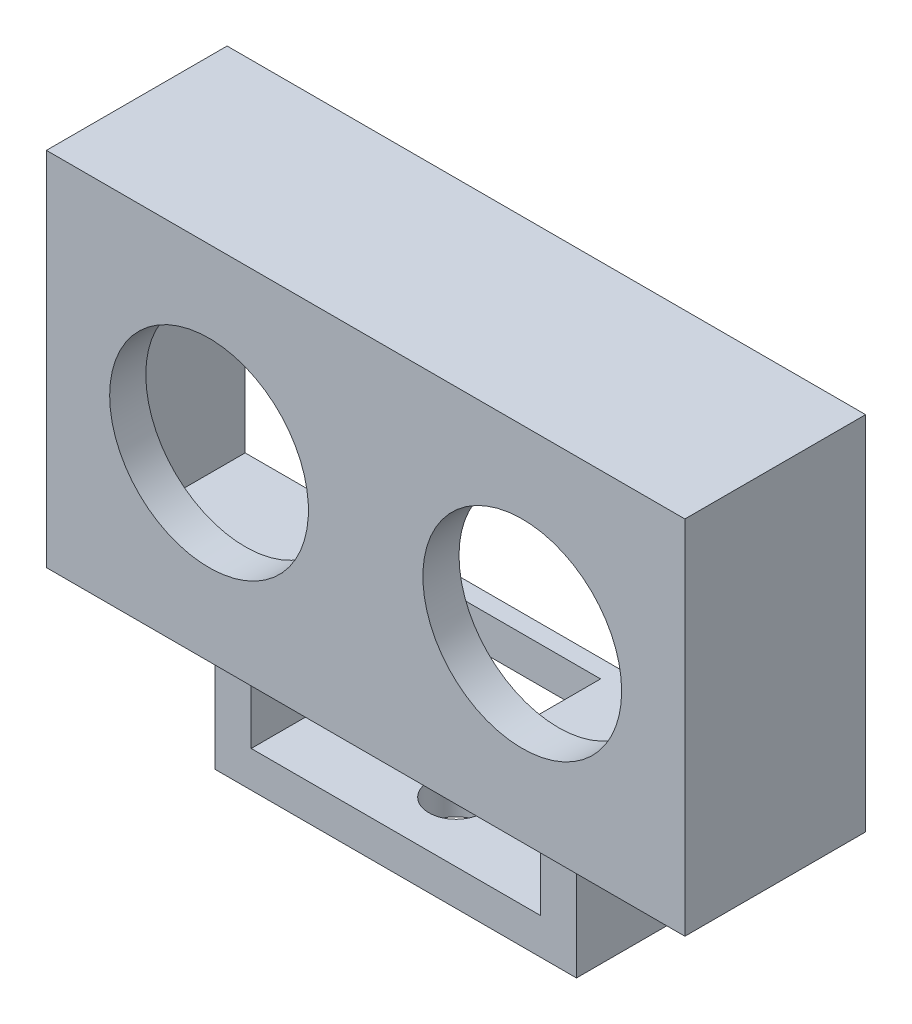
ISO-10303-21;
HEADER;
FILE_DESCRIPTION(('STEP AP214'),'2;1');
FILE_NAME('part.step','',(''),(''),'','','');
FILE_SCHEMA(('AUTOMOTIVE_DESIGN { 1 0 10303 214 1 1 1 1 }'));
ENDSEC;
DATA;
#1=APPLICATION_CONTEXT('core data for automotive mechanical design processes');
#2=APPLICATION_PROTOCOL_DEFINITION('international standard','automotive_design',2000,#1);
#3=PRODUCT_CONTEXT('',#1,'mechanical');
#4=PRODUCT('Part','Part','',(#3));
#5=PRODUCT_RELATED_PRODUCT_CATEGORY('part','',(#4));
#6=PRODUCT_DEFINITION_FORMATION('','',#4);
#7=PRODUCT_DEFINITION_CONTEXT('part definition',#1,'design');
#8=PRODUCT_DEFINITION('design','',#6,#7);
#9=PRODUCT_DEFINITION_SHAPE('','',#8);
#10=(LENGTH_UNIT() NAMED_UNIT(*) SI_UNIT(.MILLI.,.METRE.));
#11=(NAMED_UNIT(*) PLANE_ANGLE_UNIT() SI_UNIT($,.RADIAN.));
#12=(NAMED_UNIT(*) SI_UNIT($,.STERADIAN.) SOLID_ANGLE_UNIT());
#13=UNCERTAINTY_MEASURE_WITH_UNIT(LENGTH_MEASURE(1.E-05),#10,'distance_accuracy_value','');
#14=(GEOMETRIC_REPRESENTATION_CONTEXT(3) GLOBAL_UNCERTAINTY_ASSIGNED_CONTEXT((#13)) GLOBAL_UNIT_ASSIGNED_CONTEXT((#10,
#11,#12)) REPRESENTATION_CONTEXT('',''));
#15=CARTESIAN_POINT('',(0.,0.,0.));
#16=DIRECTION('',(0.,0.,1.));
#17=DIRECTION('',(1.,0.,0.));
#18=AXIS2_PLACEMENT_3D('',#15,#16,#17);
#19=CARTESIAN_POINT('',(-26.5,-15.,15.));
#20=DIRECTION('',(0.,1.,0.));
#21=DIRECTION('',(0.,0.,1.));
#22=AXIS2_PLACEMENT_3D('',#19,#20,#21);
#23=PLANE('',#22);
#24=DIRECTION('',(1.,0.,0.));
#25=VECTOR('',#24,1.);
#26=CARTESIAN_POINT('',(-26.5,-15.,0.));
#27=LINE('',#26,#25);
#28=CARTESIAN_POINT('',(-26.5,-15.,0.));
#29=VERTEX_POINT('',#28);
#30=CARTESIAN_POINT('',(26.5,-15.,0.));
#31=VERTEX_POINT('',#30);
#32=EDGE_CURVE('E347',#29,#31,#27,.T.);
#33=ORIENTED_EDGE('',*,*,#32,.T.);
#34=DIRECTION('',(0.,0.,-1.));
#35=VECTOR('',#34,1.);
#36=CARTESIAN_POINT('',(26.5,-15.,15.));
#37=LINE('',#36,#35);
#38=CARTESIAN_POINT('',(26.5,-15.,15.));
#39=VERTEX_POINT('',#38);
#40=EDGE_CURVE('E353',#39,#31,#37,.T.);
#41=ORIENTED_EDGE('',*,*,#40,.F.);
#42=DIRECTION('',(1.,0.,0.));
#43=VECTOR('',#42,1.);
#44=CARTESIAN_POINT('',(-26.5,-15.,15.));
#45=LINE('',#44,#43);
#46=CARTESIAN_POINT('',(-26.5,-15.,15.));
#47=VERTEX_POINT('',#46);
#48=EDGE_CURVE('E351',#47,#39,#45,.T.);
#49=ORIENTED_EDGE('',*,*,#48,.F.);
#50=DIRECTION('',(0.,0.,-1.));
#51=VECTOR('',#50,1.);
#52=CARTESIAN_POINT('',(-26.5,-15.,15.));
#53=LINE('',#52,#51);
#54=EDGE_CURVE('E363',#47,#29,#53,.T.);
#55=ORIENTED_EDGE('',*,*,#54,.T.);
#56=EDGE_LOOP('',(#33,#41,#49,#55));
#57=FACE_BOUND('',#56,.T.);
#58=DIRECTION('',(0.,0.,1.));
#59=VECTOR('',#58,1.);
#60=CARTESIAN_POINT('',(-12.,-15.,0.));
#61=LINE('',#60,#59);
#62=CARTESIAN_POINT('',(-12.,-15.,2.5));
#63=VERTEX_POINT('',#62);
#64=CARTESIAN_POINT('',(-12.,-15.,12.5));
#65=VERTEX_POINT('',#64);
#66=EDGE_CURVE('E49',#63,#65,#61,.T.);
#67=ORIENTED_EDGE('',*,*,#66,.F.);
#68=DIRECTION('',(1.,0.,0.));
#69=VECTOR('',#68,1.);
#70=CARTESIAN_POINT('',(-15.,-15.,2.5));
#71=LINE('',#70,#69);
#72=CARTESIAN_POINT('',(-15.,-15.,2.5));
#73=VERTEX_POINT('',#72);
#74=EDGE_CURVE('E227',#73,#63,#71,.T.);
#75=ORIENTED_EDGE('',*,*,#74,.F.);
#76=DIRECTION('',(0.,0.,-1.));
#77=VECTOR('',#76,1.);
#78=CARTESIAN_POINT('',(-15.,-15.,12.5));
#79=LINE('',#78,#77);
#80=CARTESIAN_POINT('',(-15.,-15.,12.5));
#81=VERTEX_POINT('',#80);
#82=EDGE_CURVE('E215',#81,#73,#79,.T.);
#83=ORIENTED_EDGE('',*,*,#82,.F.);
#84=DIRECTION('',(-1.,0.,0.));
#85=VECTOR('',#84,1.);
#86=CARTESIAN_POINT('',(-15.,-15.,12.5));
#87=LINE('',#86,#85);
#88=EDGE_CURVE('E208',#65,#81,#87,.T.);
#89=ORIENTED_EDGE('',*,*,#88,.F.);
#90=EDGE_LOOP('',(#67,#75,#83,#89));
#91=FACE_BOUND('',#90,.T.);
#92=CARTESIAN_POINT('',(12.,-15.,2.5));
#93=VERTEX_POINT('',#92);
#94=CARTESIAN_POINT('',(15.,-15.,2.5));
#95=VERTEX_POINT('',#94);
#96=EDGE_CURVE('E226',#93,#95,#71,.T.);
#97=ORIENTED_EDGE('',*,*,#96,.F.);
#98=DIRECTION('',(0.,0.,1.));
#99=VECTOR('',#98,1.);
#100=CARTESIAN_POINT('',(12.,-15.,0.));
#101=LINE('',#100,#99);
#102=CARTESIAN_POINT('',(12.,-15.,12.5));
#103=VERTEX_POINT('',#102);
#104=EDGE_CURVE('E202',#93,#103,#101,.T.);
#105=ORIENTED_EDGE('',*,*,#104,.T.);
#106=CARTESIAN_POINT('',(15.,-15.,12.5));
#107=VERTEX_POINT('',#106);
#108=EDGE_CURVE('E217',#107,#103,#87,.T.);
#109=ORIENTED_EDGE('',*,*,#108,.F.);
#110=DIRECTION('',(0.,0.,1.));
#111=VECTOR('',#110,1.);
#112=CARTESIAN_POINT('',(15.,-15.,12.5));
#113=LINE('',#112,#111);
#114=EDGE_CURVE('E218',#95,#107,#113,.T.);
#115=ORIENTED_EDGE('',*,*,#114,.F.);
#116=EDGE_LOOP('',(#97,#105,#109,#115));
#117=FACE_BOUND('',#116,.T.);
#118=DIRECTION('',(0.,0.,1.));
#119=VECTOR('',#118,1.);
#120=CARTESIAN_POINT('',(-7.5,-15.,15.));
#121=LINE('',#120,#119);
#122=CARTESIAN_POINT('',(-7.5,-15.,3.));
#123=VERTEX_POINT('',#122);
#124=CARTESIAN_POINT('',(-7.5,-15.,8.99999999999999));
#125=VERTEX_POINT('',#124);
#126=EDGE_CURVE('E302',#123,#125,#121,.T.);
#127=ORIENTED_EDGE('',*,*,#126,.T.);
#128=DIRECTION('',(1.,0.,0.));
#129=VECTOR('',#128,1.);
#130=CARTESIAN_POINT('',(-26.5,-15.,8.99999999999999));
#131=LINE('',#130,#129);
#132=CARTESIAN_POINT('',(7.5,-15.,9.));
#133=VERTEX_POINT('',#132);
#134=EDGE_CURVE('E304',#125,#133,#131,.T.);
#135=ORIENTED_EDGE('',*,*,#134,.T.);
#136=DIRECTION('',(0.,0.,-1.));
#137=VECTOR('',#136,1.);
#138=CARTESIAN_POINT('',(7.50000000000001,-15.,15.));
#139=LINE('',#138,#137);
#140=CARTESIAN_POINT('',(7.5,-15.,3.));
#141=VERTEX_POINT('',#140);
#142=EDGE_CURVE('E306',#133,#141,#139,.T.);
#143=ORIENTED_EDGE('',*,*,#142,.T.);
#144=DIRECTION('',(-1.,0.,0.));
#145=VECTOR('',#144,1.);
#146=CARTESIAN_POINT('',(-26.5,-15.,2.99999999999999));
#147=LINE('',#146,#145);
#148=EDGE_CURVE('E294',#141,#123,#147,.T.);
#149=ORIENTED_EDGE('',*,*,#148,.T.);
#150=EDGE_LOOP('',(#127,#135,#143,#149));
#151=FACE_BOUND('',#150,.T.);
#152=ADVANCED_FACE('F33',(#57,#91,#117,#151),#23,.F.);
#153=CARTESIAN_POINT('',(-23.5,12.,12.));
#154=DIRECTION('',(-1.,0.,0.));
#155=DIRECTION('',(0.,0.,1.));
#156=AXIS2_PLACEMENT_3D('',#153,#154,#155);
#157=PLANE('',#156);
#158=DIRECTION('',(0.,-1.,0.));
#159=VECTOR('',#158,1.);
#160=CARTESIAN_POINT('',(-23.5,12.,1.5));
#161=LINE('',#160,#159);
#162=CARTESIAN_POINT('',(-23.5,12.,1.5));
#163=VERTEX_POINT('',#162);
#164=CARTESIAN_POINT('',(-23.5,-12.,1.5));
#165=VERTEX_POINT('',#164);
#166=EDGE_CURVE('E278',#163,#165,#161,.T.);
#167=ORIENTED_EDGE('',*,*,#166,.F.);
#168=DIRECTION('',(0.,0.,-1.));
#169=VECTOR('',#168,1.);
#170=CARTESIAN_POINT('',(-23.5,12.,12.));
#171=LINE('',#170,#169);
#172=CARTESIAN_POINT('',(-23.5,12.,12.));
#173=VERTEX_POINT('',#172);
#174=EDGE_CURVE('E320',#173,#163,#171,.T.);
#175=ORIENTED_EDGE('',*,*,#174,.F.);
#176=DIRECTION('',(0.,1.,0.));
#177=VECTOR('',#176,1.);
#178=CARTESIAN_POINT('',(-23.5,12.,12.));
#179=LINE('',#178,#177);
#180=CARTESIAN_POINT('',(-23.5,-12.,12.));
#181=VERTEX_POINT('',#180);
#182=EDGE_CURVE('E308',#181,#173,#179,.T.);
#183=ORIENTED_EDGE('',*,*,#182,.F.);
#184=DIRECTION('',(0.,0.,-1.));
#185=VECTOR('',#184,1.);
#186=CARTESIAN_POINT('',(-23.5,-12.,12.));
#187=LINE('',#186,#185);
#188=EDGE_CURVE('E321',#181,#165,#187,.T.);
#189=ORIENTED_EDGE('',*,*,#188,.T.);
#190=EDGE_LOOP('',(#167,#175,#183,#189));
#191=FACE_BOUND('',#190,.T.);
#192=ADVANCED_FACE('F393',(#191),#157,.F.);
#193=CARTESIAN_POINT('',(23.5,-12.,12.));
#194=DIRECTION('',(0.,-1.,0.));
#195=DIRECTION('',(0.,0.,-1.));
#196=AXIS2_PLACEMENT_3D('',#193,#194,#195);
#197=PLANE('',#196);
#198=DIRECTION('',(-1.,0.,0.));
#199=VECTOR('',#198,1.);
#200=CARTESIAN_POINT('',(-7.5,-12.,3.));
#201=LINE('',#200,#199);
#202=CARTESIAN_POINT('',(7.5,-12.,3.));
#203=VERTEX_POINT('',#202);
#204=CARTESIAN_POINT('',(-7.5,-12.,3.));
#205=VERTEX_POINT('',#204);
#206=EDGE_CURVE('E282',#203,#205,#201,.T.);
#207=ORIENTED_EDGE('',*,*,#206,.F.);
#208=DIRECTION('',(0.,0.,-1.));
#209=VECTOR('',#208,1.);
#210=CARTESIAN_POINT('',(7.5,-12.,3.));
#211=LINE('',#210,#209);
#212=CARTESIAN_POINT('',(7.5,-12.,9.));
#213=VERTEX_POINT('',#212);
#214=EDGE_CURVE('E280',#213,#203,#211,.T.);
#215=ORIENTED_EDGE('',*,*,#214,.F.);
#216=DIRECTION('',(1.,0.,0.));
#217=VECTOR('',#216,1.);
#218=CARTESIAN_POINT('',(-7.5,-12.,8.99999999999999));
#219=LINE('',#218,#217);
#220=CARTESIAN_POINT('',(-7.5,-12.,8.99999999999999));
#221=VERTEX_POINT('',#220);
#222=EDGE_CURVE('E288',#221,#213,#219,.T.);
#223=ORIENTED_EDGE('',*,*,#222,.F.);
#224=DIRECTION('',(0.,0.,1.));
#225=VECTOR('',#224,1.);
#226=CARTESIAN_POINT('',(-7.5,-12.,3.));
#227=LINE('',#226,#225);
#228=EDGE_CURVE('E285',#205,#221,#227,.T.);
#229=ORIENTED_EDGE('',*,*,#228,.F.);
#230=EDGE_LOOP('',(#207,#215,#223,#229));
#231=FACE_BOUND('',#230,.T.);
#232=DIRECTION('',(1.,0.,0.));
#233=VECTOR('',#232,1.);
#234=CARTESIAN_POINT('',(23.5,-12.,1.5));
#235=LINE('',#234,#233);
#236=CARTESIAN_POINT('',(23.5,-12.,1.5));
#237=VERTEX_POINT('',#236);
#238=EDGE_CURVE('E276',#165,#237,#235,.T.);
#239=ORIENTED_EDGE('',*,*,#238,.F.);
#240=ORIENTED_EDGE('',*,*,#188,.F.);
#241=DIRECTION('',(-1.,0.,0.));
#242=VECTOR('',#241,1.);
#243=CARTESIAN_POINT('',(23.5,-12.,12.));
#244=LINE('',#243,#242);
#245=CARTESIAN_POINT('',(23.5,-12.,12.));
#246=VERTEX_POINT('',#245);
#247=EDGE_CURVE('E317',#246,#181,#244,.T.);
#248=ORIENTED_EDGE('',*,*,#247,.F.);
#249=DIRECTION('',(0.,0.,-1.));
#250=VECTOR('',#249,1.);
#251=CARTESIAN_POINT('',(23.5,-12.,12.));
#252=LINE('',#251,#250);
#253=EDGE_CURVE('E325',#246,#237,#252,.T.);
#254=ORIENTED_EDGE('',*,*,#253,.T.);
#255=EDGE_LOOP('',(#239,#240,#248,#254));
#256=FACE_BOUND('',#255,.T.);
#257=ADVANCED_FACE('F399',(#231,#256),#197,.F.);
#258=CARTESIAN_POINT('',(23.5,12.,12.));
#259=DIRECTION('',(1.,0.,0.));
#260=DIRECTION('',(0.,0.,-1.));
#261=AXIS2_PLACEMENT_3D('',#258,#259,#260);
#262=PLANE('',#261);
#263=DIRECTION('',(0.,1.,0.));
#264=VECTOR('',#263,1.);
#265=CARTESIAN_POINT('',(23.5,12.,1.5));
#266=LINE('',#265,#264);
#267=CARTESIAN_POINT('',(23.5,12.,1.5));
#268=VERTEX_POINT('',#267);
#269=EDGE_CURVE('E268',#237,#268,#266,.T.);
#270=ORIENTED_EDGE('',*,*,#269,.F.);
#271=ORIENTED_EDGE('',*,*,#253,.F.);
#272=DIRECTION('',(0.,-1.,0.));
#273=VECTOR('',#272,1.);
#274=CARTESIAN_POINT('',(23.5,12.,12.));
#275=LINE('',#274,#273);
#276=CARTESIAN_POINT('',(23.5,12.,12.));
#277=VERTEX_POINT('',#276);
#278=EDGE_CURVE('E314',#277,#246,#275,.T.);
#279=ORIENTED_EDGE('',*,*,#278,.F.);
#280=DIRECTION('',(0.,0.,-1.));
#281=VECTOR('',#280,1.);
#282=CARTESIAN_POINT('',(23.5,12.,12.));
#283=LINE('',#282,#281);
#284=EDGE_CURVE('E328',#277,#268,#283,.T.);
#285=ORIENTED_EDGE('',*,*,#284,.T.);
#286=EDGE_LOOP('',(#270,#271,#279,#285));
#287=FACE_BOUND('',#286,.T.);
#288=ADVANCED_FACE('F450',(#287),#262,.F.);
#289=CARTESIAN_POINT('',(23.5,12.,12.));
#290=DIRECTION('',(0.,1.,0.));
#291=DIRECTION('',(0.,0.,1.));
#292=AXIS2_PLACEMENT_3D('',#289,#290,#291);
#293=PLANE('',#292);
#294=DIRECTION('',(-1.,0.,0.));
#295=VECTOR('',#294,1.);
#296=CARTESIAN_POINT('',(23.5,12.,1.5));
#297=LINE('',#296,#295);
#298=EDGE_CURVE('E11',#268,#163,#297,.T.);
#299=ORIENTED_EDGE('',*,*,#298,.F.);
#300=ORIENTED_EDGE('',*,*,#284,.F.);
#301=DIRECTION('',(1.,0.,0.));
#302=VECTOR('',#301,1.);
#303=CARTESIAN_POINT('',(23.5,12.,12.));
#304=LINE('',#303,#302);
#305=EDGE_CURVE('E311',#173,#277,#304,.T.);
#306=ORIENTED_EDGE('',*,*,#305,.F.);
#307=ORIENTED_EDGE('',*,*,#174,.T.);
#308=EDGE_LOOP('',(#299,#300,#306,#307));
#309=FACE_BOUND('',#308,.T.);
#310=ADVANCED_FACE('F388',(#309),#293,.F.);
#311=CARTESIAN_POINT('',(-13.,0.,0.));
#312=DIRECTION('',(0.,0.,1.));
#313=DIRECTION('',(1.,0.,0.));
#314=AXIS2_PLACEMENT_3D('',#311,#312,#313);
#315=CYLINDRICAL_SURFACE('',#314,8.25);
#316=CARTESIAN_POINT('',(-13.,0.,15.));
#317=DIRECTION('',(0.,0.,1.));
#318=DIRECTION('',(-1.,0.,0.));
#319=AXIS2_PLACEMENT_3D('',#316,#317,#318);
#320=CIRCLE('',#319,8.25);
#321=CARTESIAN_POINT('',(-21.25,0.,15.));
#322=VERTEX_POINT('',#321);
#323=EDGE_CURVE('E336',#322,#322,#320,.T.);
#324=ORIENTED_EDGE('',*,*,#323,.T.);
#325=EDGE_LOOP('',(#324));
#326=FACE_BOUND('',#325,.T.);
#327=CARTESIAN_POINT('',(-13.,0.,12.));
#328=DIRECTION('',(0.,0.,-1.));
#329=DIRECTION('',(-1.,0.,0.));
#330=AXIS2_PLACEMENT_3D('',#327,#328,#329);
#331=CIRCLE('',#330,8.25);
#332=CARTESIAN_POINT('',(-21.25,0.,12.));
#333=VERTEX_POINT('',#332);
#334=EDGE_CURVE('E333',#333,#333,#331,.F.);
#335=ORIENTED_EDGE('',*,*,#334,.F.);
#336=EDGE_LOOP('',(#335));
#337=FACE_BOUND('',#336,.T.);
#338=ADVANCED_FACE('F379',(#326,#337),#315,.F.);
#339=CARTESIAN_POINT('',(13.,0.,0.));
#340=DIRECTION('',(0.,0.,1.));
#341=DIRECTION('',(1.,0.,0.));
#342=AXIS2_PLACEMENT_3D('',#339,#340,#341);
#343=CYLINDRICAL_SURFACE('',#342,8.25);
#344=CARTESIAN_POINT('',(13.,0.,15.));
#345=DIRECTION('',(0.,0.,1.));
#346=DIRECTION('',(1.,0.,0.));
#347=AXIS2_PLACEMENT_3D('',#344,#345,#346);
#348=CIRCLE('',#347,8.25);
#349=CARTESIAN_POINT('',(21.25,0.,15.));
#350=VERTEX_POINT('',#349);
#351=EDGE_CURVE('E337',#350,#350,#348,.T.);
#352=ORIENTED_EDGE('',*,*,#351,.T.);
#353=EDGE_LOOP('',(#352));
#354=FACE_BOUND('',#353,.T.);
#355=CARTESIAN_POINT('',(13.,0.,12.));
#356=DIRECTION('',(0.,0.,-1.));
#357=DIRECTION('',(-1.,0.,0.));
#358=AXIS2_PLACEMENT_3D('',#355,#356,#357);
#359=CIRCLE('',#358,8.25);
#360=CARTESIAN_POINT('',(4.75,0.,12.));
#361=VERTEX_POINT('',#360);
#362=EDGE_CURVE('E324',#361,#361,#359,.F.);
#363=ORIENTED_EDGE('',*,*,#362,.F.);
#364=EDGE_LOOP('',(#363));
#365=FACE_BOUND('',#364,.T.);
#366=ADVANCED_FACE('F377',(#354,#365),#343,.F.);
#367=CARTESIAN_POINT('',(26.5,15.,15.));
#368=DIRECTION('',(-1.,0.,0.));
#369=DIRECTION('',(0.,0.,1.));
#370=AXIS2_PLACEMENT_3D('',#367,#368,#369);
#371=PLANE('',#370);
#372=DIRECTION('',(0.,1.,0.));
#373=VECTOR('',#372,1.);
#374=CARTESIAN_POINT('',(26.5,15.,0.));
#375=LINE('',#374,#373);
#376=CARTESIAN_POINT('',(26.5,15.,0.));
#377=VERTEX_POINT('',#376);
#378=EDGE_CURVE('E340',#31,#377,#375,.T.);
#379=ORIENTED_EDGE('',*,*,#378,.T.);
#380=DIRECTION('',(0.,0.,-1.));
#381=VECTOR('',#380,1.);
#382=CARTESIAN_POINT('',(26.5,15.,15.));
#383=LINE('',#382,#381);
#384=CARTESIAN_POINT('',(26.5,15.,15.));
#385=VERTEX_POINT('',#384);
#386=EDGE_CURVE('E42',#385,#377,#383,.T.);
#387=ORIENTED_EDGE('',*,*,#386,.F.);
#388=DIRECTION('',(0.,1.,0.));
#389=VECTOR('',#388,1.);
#390=CARTESIAN_POINT('',(26.5,15.,15.));
#391=LINE('',#390,#389);
#392=EDGE_CURVE('E343',#39,#385,#391,.T.);
#393=ORIENTED_EDGE('',*,*,#392,.F.);
#394=ORIENTED_EDGE('',*,*,#40,.T.);
#395=EDGE_LOOP('',(#379,#387,#393,#394));
#396=FACE_BOUND('',#395,.T.);
#397=ADVANCED_FACE('F35',(#396),#371,.F.);
#398=CARTESIAN_POINT('',(-26.5,15.,15.));
#399=DIRECTION('',(0.,-1.,0.));
#400=DIRECTION('',(0.,0.,-1.));
#401=AXIS2_PLACEMENT_3D('',#398,#399,#400);
#402=PLANE('',#401);
#403=DIRECTION('',(-1.,0.,0.));
#404=VECTOR('',#403,1.);
#405=CARTESIAN_POINT('',(-26.5,15.,0.));
#406=LINE('',#405,#404);
#407=CARTESIAN_POINT('',(-26.5,15.,0.));
#408=VERTEX_POINT('',#407);
#409=EDGE_CURVE('E356',#377,#408,#406,.T.);
#410=ORIENTED_EDGE('',*,*,#409,.T.);
#411=DIRECTION('',(0.,0.,-1.));
#412=VECTOR('',#411,1.);
#413=CARTESIAN_POINT('',(-26.5,15.,15.));
#414=LINE('',#413,#412);
#415=CARTESIAN_POINT('',(-26.5,15.,15.));
#416=VERTEX_POINT('',#415);
#417=EDGE_CURVE('E366',#416,#408,#414,.T.);
#418=ORIENTED_EDGE('',*,*,#417,.F.);
#419=DIRECTION('',(-1.,0.,0.));
#420=VECTOR('',#419,1.);
#421=CARTESIAN_POINT('',(-26.5,15.,15.));
#422=LINE('',#421,#420);
#423=EDGE_CURVE('E346',#385,#416,#422,.T.);
#424=ORIENTED_EDGE('',*,*,#423,.F.);
#425=ORIENTED_EDGE('',*,*,#386,.T.);
#426=EDGE_LOOP('',(#410,#418,#424,#425));
#427=FACE_BOUND('',#426,.T.);
#428=ADVANCED_FACE('F386',(#427),#402,.F.);
#429=CARTESIAN_POINT('',(-26.5,15.,15.));
#430=DIRECTION('',(1.,0.,0.));
#431=DIRECTION('',(0.,1.,0.));
#432=AXIS2_PLACEMENT_3D('',#429,#430,#431);
#433=PLANE('',#432);
#434=DIRECTION('',(0.,-1.,0.));
#435=VECTOR('',#434,1.);
#436=CARTESIAN_POINT('',(-26.5,15.,0.));
#437=LINE('',#436,#435);
#438=EDGE_CURVE('E358',#408,#29,#437,.T.);
#439=ORIENTED_EDGE('',*,*,#438,.T.);
#440=ORIENTED_EDGE('',*,*,#54,.F.);
#441=DIRECTION('',(0.,-1.,0.));
#442=VECTOR('',#441,1.);
#443=CARTESIAN_POINT('',(-26.5,15.,15.));
#444=LINE('',#443,#442);
#445=EDGE_CURVE('E349',#416,#47,#444,.T.);
#446=ORIENTED_EDGE('',*,*,#445,.F.);
#447=ORIENTED_EDGE('',*,*,#417,.T.);
#448=EDGE_LOOP('',(#439,#440,#446,#447));
#449=FACE_BOUND('',#448,.T.);
#450=ADVANCED_FACE('F405',(#449),#433,.F.);
#451=CARTESIAN_POINT('',(0.,0.,15.));
#452=DIRECTION('',(0.,0.,1.));
#453=DIRECTION('',(1.,0.,0.));
#454=AXIS2_PLACEMENT_3D('',#451,#452,#453);
#455=PLANE('',#454);
#456=ORIENTED_EDGE('',*,*,#351,.F.);
#457=EDGE_LOOP('',(#456));
#458=FACE_BOUND('',#457,.T.);
#459=ORIENTED_EDGE('',*,*,#323,.F.);
#460=EDGE_LOOP('',(#459));
#461=FACE_BOUND('',#460,.T.);
#462=ORIENTED_EDGE('',*,*,#392,.T.);
#463=ORIENTED_EDGE('',*,*,#423,.T.);
#464=ORIENTED_EDGE('',*,*,#445,.T.);
#465=ORIENTED_EDGE('',*,*,#48,.T.);
#466=EDGE_LOOP('',(#462,#463,#464,#465));
#467=FACE_BOUND('',#466,.T.);
#468=ADVANCED_FACE('F407',(#458,#461,#467),#455,.T.);
#469=CARTESIAN_POINT('',(0.,0.,0.));
#470=DIRECTION('',(0.,0.,1.));
#471=DIRECTION('',(1.,0.,0.));
#472=AXIS2_PLACEMENT_3D('',#469,#470,#471);
#473=PLANE('',#472);
#474=DIRECTION('',(1.,0.,0.));
#475=VECTOR('',#474,1.);
#476=CARTESIAN_POINT('',(25.,13.5,0.));
#477=LINE('',#476,#475);
#478=CARTESIAN_POINT('',(-25.,13.5,0.));
#479=VERTEX_POINT('',#478);
#480=CARTESIAN_POINT('',(25.,13.5,0.));
#481=VERTEX_POINT('',#480);
#482=EDGE_CURVE('E258',#479,#481,#477,.T.);
#483=ORIENTED_EDGE('',*,*,#482,.F.);
#484=DIRECTION('',(0.,1.,0.));
#485=VECTOR('',#484,1.);
#486=CARTESIAN_POINT('',(-25.,13.5,0.));
#487=LINE('',#486,#485);
#488=CARTESIAN_POINT('',(-25.,-13.5,0.));
#489=VERTEX_POINT('',#488);
#490=EDGE_CURVE('E242',#489,#479,#487,.T.);
#491=ORIENTED_EDGE('',*,*,#490,.F.);
#492=DIRECTION('',(-1.,0.,0.));
#493=VECTOR('',#492,1.);
#494=CARTESIAN_POINT('',(25.,-13.5,0.));
#495=LINE('',#494,#493);
#496=CARTESIAN_POINT('',(25.,-13.5,0.));
#497=VERTEX_POINT('',#496);
#498=EDGE_CURVE('E247',#497,#489,#495,.T.);
#499=ORIENTED_EDGE('',*,*,#498,.F.);
#500=DIRECTION('',(0.,-1.,0.));
#501=VECTOR('',#500,1.);
#502=CARTESIAN_POINT('',(25.,13.5,0.));
#503=LINE('',#502,#501);
#504=EDGE_CURVE('E261',#481,#497,#503,.T.);
#505=ORIENTED_EDGE('',*,*,#504,.F.);
#506=EDGE_LOOP('',(#483,#491,#499,#505));
#507=FACE_BOUND('',#506,.T.);
#508=ORIENTED_EDGE('',*,*,#378,.F.);
#509=ORIENTED_EDGE('',*,*,#32,.F.);
#510=ORIENTED_EDGE('',*,*,#438,.F.);
#511=ORIENTED_EDGE('',*,*,#409,.F.);
#512=EDGE_LOOP('',(#508,#509,#510,#511));
#513=FACE_BOUND('',#512,.T.);
#514=ADVANCED_FACE('F403',(#507,#513),#473,.F.);
#515=CARTESIAN_POINT('',(0.,0.,12.));
#516=DIRECTION('',(0.,0.,-1.));
#517=DIRECTION('',(-1.,0.,0.));
#518=AXIS2_PLACEMENT_3D('',#515,#516,#517);
#519=PLANE('',#518);
#520=ORIENTED_EDGE('',*,*,#182,.T.);
#521=ORIENTED_EDGE('',*,*,#305,.T.);
#522=ORIENTED_EDGE('',*,*,#278,.T.);
#523=ORIENTED_EDGE('',*,*,#247,.T.);
#524=EDGE_LOOP('',(#520,#521,#522,#523));
#525=FACE_BOUND('',#524,.T.);
#526=ORIENTED_EDGE('',*,*,#362,.T.);
#527=EDGE_LOOP('',(#526));
#528=FACE_BOUND('',#527,.T.);
#529=ORIENTED_EDGE('',*,*,#334,.T.);
#530=EDGE_LOOP('',(#529));
#531=FACE_BOUND('',#530,.T.);
#532=ADVANCED_FACE('F374',(#525,#528,#531),#519,.T.);
#533=CARTESIAN_POINT('',(7.5,-24.,3.));
#534=DIRECTION('',(1.,0.,0.));
#535=DIRECTION('',(0.,0.,-1.));
#536=AXIS2_PLACEMENT_3D('',#533,#534,#535);
#537=PLANE('',#536);
#538=DIRECTION('',(0.,1.,0.));
#539=VECTOR('',#538,1.);
#540=CARTESIAN_POINT('',(7.5,-24.,9.));
#541=LINE('',#540,#539);
#542=EDGE_CURVE('E292',#133,#213,#541,.T.);
#543=ORIENTED_EDGE('',*,*,#542,.T.);
#544=ORIENTED_EDGE('',*,*,#214,.T.);
#545=DIRECTION('',(0.,1.,0.));
#546=VECTOR('',#545,1.);
#547=CARTESIAN_POINT('',(7.5,-24.,3.));
#548=LINE('',#547,#546);
#549=EDGE_CURVE('E291',#141,#203,#548,.T.);
#550=ORIENTED_EDGE('',*,*,#549,.F.);
#551=ORIENTED_EDGE('',*,*,#142,.F.);
#552=EDGE_LOOP('',(#543,#544,#550,#551));
#553=FACE_BOUND('',#552,.T.);
#554=ADVANCED_FACE('F437',(#553),#537,.F.);
#555=CARTESIAN_POINT('',(-7.5,-24.,8.99999999999999));
#556=DIRECTION('',(0.,0.,1.));
#557=DIRECTION('',(1.,0.,0.));
#558=AXIS2_PLACEMENT_3D('',#555,#556,#557);
#559=PLANE('',#558);
#560=DIRECTION('',(0.,1.,0.));
#561=VECTOR('',#560,1.);
#562=CARTESIAN_POINT('',(-7.5,-24.,8.99999999999999));
#563=LINE('',#562,#561);
#564=EDGE_CURVE('E295',#125,#221,#563,.T.);
#565=ORIENTED_EDGE('',*,*,#564,.T.);
#566=ORIENTED_EDGE('',*,*,#222,.T.);
#567=ORIENTED_EDGE('',*,*,#542,.F.);
#568=ORIENTED_EDGE('',*,*,#134,.F.);
#569=EDGE_LOOP('',(#565,#566,#567,#568));
#570=FACE_BOUND('',#569,.T.);
#571=ADVANCED_FACE('F443',(#570),#559,.F.);
#572=CARTESIAN_POINT('',(-7.5,-24.,3.));
#573=DIRECTION('',(-1.,0.,0.));
#574=DIRECTION('',(0.,0.,1.));
#575=AXIS2_PLACEMENT_3D('',#572,#573,#574);
#576=PLANE('',#575);
#577=DIRECTION('',(0.,1.,0.));
#578=VECTOR('',#577,1.);
#579=CARTESIAN_POINT('',(-7.5,-24.,3.));
#580=LINE('',#579,#578);
#581=EDGE_CURVE('E297',#123,#205,#580,.T.);
#582=ORIENTED_EDGE('',*,*,#581,.T.);
#583=ORIENTED_EDGE('',*,*,#228,.T.);
#584=ORIENTED_EDGE('',*,*,#564,.F.);
#585=ORIENTED_EDGE('',*,*,#126,.F.);
#586=EDGE_LOOP('',(#582,#583,#584,#585));
#587=FACE_BOUND('',#586,.T.);
#588=ADVANCED_FACE('F482',(#587),#576,.F.);
#589=CARTESIAN_POINT('',(-7.5,-24.,3.));
#590=DIRECTION('',(0.,0.,-1.));
#591=DIRECTION('',(-1.,0.,0.));
#592=AXIS2_PLACEMENT_3D('',#589,#590,#591);
#593=PLANE('',#592);
#594=ORIENTED_EDGE('',*,*,#549,.T.);
#595=ORIENTED_EDGE('',*,*,#206,.T.);
#596=ORIENTED_EDGE('',*,*,#581,.F.);
#597=ORIENTED_EDGE('',*,*,#148,.F.);
#598=EDGE_LOOP('',(#594,#595,#596,#597));
#599=FACE_BOUND('',#598,.T.);
#600=ADVANCED_FACE('F472',(#599),#593,.F.);
#601=CARTESIAN_POINT('',(0.,0.,1.5));
#602=DIRECTION('',(0.,0.,-1.));
#603=DIRECTION('',(-1.,0.,0.));
#604=AXIS2_PLACEMENT_3D('',#601,#602,#603);
#605=PLANE('',#604);
#606=DIRECTION('',(0.,1.,0.));
#607=VECTOR('',#606,1.);
#608=CARTESIAN_POINT('',(-25.,13.5,1.5));
#609=LINE('',#608,#607);
#610=CARTESIAN_POINT('',(-25.,-13.5,1.5));
#611=VERTEX_POINT('',#610);
#612=CARTESIAN_POINT('',(-25.,13.5,1.5));
#613=VERTEX_POINT('',#612);
#614=EDGE_CURVE('E243',#611,#613,#609,.T.);
#615=ORIENTED_EDGE('',*,*,#614,.T.);
#616=DIRECTION('',(1.,0.,0.));
#617=VECTOR('',#616,1.);
#618=CARTESIAN_POINT('',(25.,13.5,1.5));
#619=LINE('',#618,#617);
#620=CARTESIAN_POINT('',(25.,13.5,1.5));
#621=VERTEX_POINT('',#620);
#622=EDGE_CURVE('E246',#613,#621,#619,.T.);
#623=ORIENTED_EDGE('',*,*,#622,.T.);
#624=DIRECTION('',(0.,-1.,0.));
#625=VECTOR('',#624,1.);
#626=CARTESIAN_POINT('',(25.,13.5,1.5));
#627=LINE('',#626,#625);
#628=CARTESIAN_POINT('',(25.,-13.5,1.5));
#629=VERTEX_POINT('',#628);
#630=EDGE_CURVE('E250',#621,#629,#627,.T.);
#631=ORIENTED_EDGE('',*,*,#630,.T.);
#632=DIRECTION('',(-1.,0.,0.));
#633=VECTOR('',#632,1.);
#634=CARTESIAN_POINT('',(25.,-13.5,1.5));
#635=LINE('',#634,#633);
#636=EDGE_CURVE('E253',#629,#611,#635,.T.);
#637=ORIENTED_EDGE('',*,*,#636,.T.);
#638=EDGE_LOOP('',(#615,#623,#631,#637));
#639=FACE_BOUND('',#638,.T.);
#640=ORIENTED_EDGE('',*,*,#166,.T.);
#641=ORIENTED_EDGE('',*,*,#238,.T.);
#642=ORIENTED_EDGE('',*,*,#269,.T.);
#643=ORIENTED_EDGE('',*,*,#298,.T.);
#644=EDGE_LOOP('',(#640,#641,#642,#643));
#645=FACE_BOUND('',#644,.T.);
#646=ADVANCED_FACE('F468',(#639,#645),#605,.T.);
#647=CARTESIAN_POINT('',(-25.,13.5,1.5));
#648=DIRECTION('',(-1.,0.,0.));
#649=DIRECTION('',(0.,0.,1.));
#650=AXIS2_PLACEMENT_3D('',#647,#648,#649);
#651=PLANE('',#650);
#652=ORIENTED_EDGE('',*,*,#490,.T.);
#653=DIRECTION('',(0.,0.,-1.));
#654=VECTOR('',#653,1.);
#655=CARTESIAN_POINT('',(-25.,13.5,1.5));
#656=LINE('',#655,#654);
#657=EDGE_CURVE('E256',#613,#479,#656,.T.);
#658=ORIENTED_EDGE('',*,*,#657,.F.);
#659=ORIENTED_EDGE('',*,*,#614,.F.);
#660=DIRECTION('',(0.,0.,-1.));
#661=VECTOR('',#660,1.);
#662=CARTESIAN_POINT('',(-25.,-13.5,1.5));
#663=LINE('',#662,#661);
#664=EDGE_CURVE('E266',#611,#489,#663,.T.);
#665=ORIENTED_EDGE('',*,*,#664,.T.);
#666=EDGE_LOOP('',(#652,#658,#659,#665));
#667=FACE_BOUND('',#666,.T.);
#668=ADVANCED_FACE('F471',(#667),#651,.F.);
#669=CARTESIAN_POINT('',(25.,-13.5,1.5));
#670=DIRECTION('',(0.,-1.,0.));
#671=DIRECTION('',(0.,0.,-1.));
#672=AXIS2_PLACEMENT_3D('',#669,#670,#671);
#673=PLANE('',#672);
#674=ORIENTED_EDGE('',*,*,#498,.T.);
#675=ORIENTED_EDGE('',*,*,#664,.F.);
#676=ORIENTED_EDGE('',*,*,#636,.F.);
#677=DIRECTION('',(0.,0.,-1.));
#678=VECTOR('',#677,1.);
#679=CARTESIAN_POINT('',(25.,-13.5,1.5));
#680=LINE('',#679,#678);
#681=EDGE_CURVE('E269',#629,#497,#680,.T.);
#682=ORIENTED_EDGE('',*,*,#681,.T.);
#683=EDGE_LOOP('',(#674,#675,#676,#682));
#684=FACE_BOUND('',#683,.T.);
#685=ADVANCED_FACE('F479',(#684),#673,.F.);
#686=CARTESIAN_POINT('',(25.,13.5,1.5));
#687=DIRECTION('',(1.,0.,0.));
#688=DIRECTION('',(0.,0.,-1.));
#689=AXIS2_PLACEMENT_3D('',#686,#687,#688);
#690=PLANE('',#689);
#691=ORIENTED_EDGE('',*,*,#504,.T.);
#692=ORIENTED_EDGE('',*,*,#681,.F.);
#693=ORIENTED_EDGE('',*,*,#630,.F.);
#694=DIRECTION('',(0.,0.,-1.));
#695=VECTOR('',#694,1.);
#696=CARTESIAN_POINT('',(25.,13.5,1.5));
#697=LINE('',#696,#695);
#698=EDGE_CURVE('E271',#621,#481,#697,.T.);
#699=ORIENTED_EDGE('',*,*,#698,.T.);
#700=EDGE_LOOP('',(#691,#692,#693,#699));
#701=FACE_BOUND('',#700,.T.);
#702=ADVANCED_FACE('F490',(#701),#690,.F.);
#703=CARTESIAN_POINT('',(25.,13.5,1.5));
#704=DIRECTION('',(0.,1.,0.));
#705=DIRECTION('',(0.,0.,1.));
#706=AXIS2_PLACEMENT_3D('',#703,#704,#705);
#707=PLANE('',#706);
#708=ORIENTED_EDGE('',*,*,#482,.T.);
#709=ORIENTED_EDGE('',*,*,#698,.F.);
#710=ORIENTED_EDGE('',*,*,#622,.F.);
#711=ORIENTED_EDGE('',*,*,#657,.T.);
#712=EDGE_LOOP('',(#708,#709,#710,#711));
#713=FACE_BOUND('',#712,.T.);
#714=ADVANCED_FACE('F494',(#713),#707,.F.);
#715=CARTESIAN_POINT('',(0.,-25.,0.));
#716=DIRECTION('',(0.,-1.,0.));
#717=DIRECTION('',(0.,0.,-1.));
#718=AXIS2_PLACEMENT_3D('',#715,#716,#717);
#719=PLANE('',#718);
#720=CARTESIAN_POINT('',(0.,-25.,7.5));
#721=DIRECTION('',(0.,-1.,0.));
#722=DIRECTION('',(0.,0.,-1.));
#723=AXIS2_PLACEMENT_3D('',#720,#721,#722);
#724=CIRCLE('',#723,2.25);
#725=CARTESIAN_POINT('',(0.,-25.,5.25));
#726=VERTEX_POINT('',#725);
#727=EDGE_CURVE('E632',#726,#726,#724,.T.);
#728=ORIENTED_EDGE('',*,*,#727,.F.);
#729=EDGE_LOOP('',(#728));
#730=FACE_BOUND('',#729,.T.);
#731=DIRECTION('',(0.,0.,1.));
#732=VECTOR('',#731,1.);
#733=CARTESIAN_POINT('',(15.,-25.,12.5));
#734=LINE('',#733,#732);
#735=CARTESIAN_POINT('',(15.,-25.,2.5));
#736=VERTEX_POINT('',#735);
#737=CARTESIAN_POINT('',(15.,-25.,12.5));
#738=VERTEX_POINT('',#737);
#739=EDGE_CURVE('E229',#736,#738,#734,.T.);
#740=ORIENTED_EDGE('',*,*,#739,.T.);
#741=DIRECTION('',(-1.,0.,0.));
#742=VECTOR('',#741,1.);
#743=CARTESIAN_POINT('',(-15.,-25.,12.5));
#744=LINE('',#743,#742);
#745=CARTESIAN_POINT('',(-15.,-25.,12.5));
#746=VERTEX_POINT('',#745);
#747=EDGE_CURVE('E616',#738,#746,#744,.T.);
#748=ORIENTED_EDGE('',*,*,#747,.T.);
#749=DIRECTION('',(0.,0.,-1.));
#750=VECTOR('',#749,1.);
#751=CARTESIAN_POINT('',(-15.,-25.,12.5));
#752=LINE('',#751,#750);
#753=CARTESIAN_POINT('',(-15.,-25.,2.5));
#754=VERTEX_POINT('',#753);
#755=EDGE_CURVE('E615',#746,#754,#752,.T.);
#756=ORIENTED_EDGE('',*,*,#755,.T.);
#757=DIRECTION('',(1.,0.,0.));
#758=VECTOR('',#757,1.);
#759=CARTESIAN_POINT('',(-15.,-25.,2.5));
#760=LINE('',#759,#758);
#761=EDGE_CURVE('E234',#754,#736,#760,.T.);
#762=ORIENTED_EDGE('',*,*,#761,.T.);
#763=EDGE_LOOP('',(#740,#748,#756,#762));
#764=FACE_BOUND('',#763,.T.);
#765=ADVANCED_FACE('F497',(#730,#764),#719,.T.);
#766=CARTESIAN_POINT('',(-15.,-25.,2.5));
#767=DIRECTION('',(0.,0.,1.));
#768=DIRECTION('',(1.,0.,0.));
#769=AXIS2_PLACEMENT_3D('',#766,#767,#768);
#770=PLANE('',#769);
#771=DIRECTION('',(1.,0.,0.));
#772=VECTOR('',#771,1.);
#773=CARTESIAN_POINT('',(-15.,-22.,2.5));
#774=LINE('',#773,#772);
#775=CARTESIAN_POINT('',(-12.,-22.,2.5));
#776=VERTEX_POINT('',#775);
#777=CARTESIAN_POINT('',(12.,-22.,2.5));
#778=VERTEX_POINT('',#777);
#779=EDGE_CURVE('E623',#776,#778,#774,.T.);
#780=ORIENTED_EDGE('',*,*,#779,.T.);
#781=DIRECTION('',(0.,1.,0.));
#782=VECTOR('',#781,1.);
#783=CARTESIAN_POINT('',(12.,-25.,2.5));
#784=LINE('',#783,#782);
#785=EDGE_CURVE('E221',#778,#93,#784,.T.);
#786=ORIENTED_EDGE('',*,*,#785,.T.);
#787=ORIENTED_EDGE('',*,*,#96,.T.);
#788=DIRECTION('',(0.,1.,0.));
#789=VECTOR('',#788,1.);
#790=CARTESIAN_POINT('',(15.,-25.,2.5));
#791=LINE('',#790,#789);
#792=EDGE_CURVE('E230',#736,#95,#791,.T.);
#793=ORIENTED_EDGE('',*,*,#792,.F.);
#794=ORIENTED_EDGE('',*,*,#761,.F.);
#795=DIRECTION('',(0.,1.,0.));
#796=VECTOR('',#795,1.);
#797=CARTESIAN_POINT('',(-15.,-25.,2.5));
#798=LINE('',#797,#796);
#799=EDGE_CURVE('E233',#754,#73,#798,.T.);
#800=ORIENTED_EDGE('',*,*,#799,.T.);
#801=ORIENTED_EDGE('',*,*,#74,.T.);
#802=DIRECTION('',(0.,-1.,0.));
#803=VECTOR('',#802,1.);
#804=CARTESIAN_POINT('',(-12.,-25.,2.5));
#805=LINE('',#804,#803);
#806=EDGE_CURVE('E199',#63,#776,#805,.T.);
#807=ORIENTED_EDGE('',*,*,#806,.T.);
#808=EDGE_LOOP('',(#780,#786,#787,#793,#794,#800,#801,#807));
#809=FACE_BOUND('',#808,.T.);
#810=ADVANCED_FACE('F532',(#809),#770,.F.);
#811=CARTESIAN_POINT('',(-15.,-25.,12.5));
#812=DIRECTION('',(1.,0.,0.));
#813=DIRECTION('',(0.,0.,-1.));
#814=AXIS2_PLACEMENT_3D('',#811,#812,#813);
#815=PLANE('',#814);
#816=ORIENTED_EDGE('',*,*,#82,.T.);
#817=ORIENTED_EDGE('',*,*,#799,.F.);
#818=ORIENTED_EDGE('',*,*,#755,.F.);
#819=DIRECTION('',(0.,1.,0.));
#820=VECTOR('',#819,1.);
#821=CARTESIAN_POINT('',(-15.,-25.,12.5));
#822=LINE('',#821,#820);
#823=EDGE_CURVE('E237',#746,#81,#822,.T.);
#824=ORIENTED_EDGE('',*,*,#823,.T.);
#825=EDGE_LOOP('',(#816,#817,#818,#824));
#826=FACE_BOUND('',#825,.T.);
#827=ADVANCED_FACE('F537',(#826),#815,.F.);
#828=CARTESIAN_POINT('',(-15.,-25.,12.5));
#829=DIRECTION('',(0.,0.,-1.));
#830=DIRECTION('',(-1.,0.,0.));
#831=AXIS2_PLACEMENT_3D('',#828,#829,#830);
#832=PLANE('',#831);
#833=ORIENTED_EDGE('',*,*,#108,.T.);
#834=DIRECTION('',(0.,1.,0.));
#835=VECTOR('',#834,1.);
#836=CARTESIAN_POINT('',(12.,-15.,12.5));
#837=LINE('',#836,#835);
#838=CARTESIAN_POINT('',(12.,-22.,12.5));
#839=VERTEX_POINT('',#838);
#840=EDGE_CURVE('E57',#839,#103,#837,.T.);
#841=ORIENTED_EDGE('',*,*,#840,.F.);
#842=DIRECTION('',(1.,0.,0.));
#843=VECTOR('',#842,1.);
#844=CARTESIAN_POINT('',(-12.,-22.,12.5));
#845=LINE('',#844,#843);
#846=CARTESIAN_POINT('',(-12.,-22.,12.5));
#847=VERTEX_POINT('',#846);
#848=EDGE_CURVE('E211',#847,#839,#845,.T.);
#849=ORIENTED_EDGE('',*,*,#848,.F.);
#850=DIRECTION('',(0.,-1.,0.));
#851=VECTOR('',#850,1.);
#852=CARTESIAN_POINT('',(-12.,-15.,12.5));
#853=LINE('',#852,#851);
#854=EDGE_CURVE('E196',#65,#847,#853,.T.);
#855=ORIENTED_EDGE('',*,*,#854,.F.);
#856=ORIENTED_EDGE('',*,*,#88,.T.);
#857=ORIENTED_EDGE('',*,*,#823,.F.);
#858=ORIENTED_EDGE('',*,*,#747,.F.);
#859=DIRECTION('',(0.,1.,0.));
#860=VECTOR('',#859,1.);
#861=CARTESIAN_POINT('',(15.,-25.,12.5));
#862=LINE('',#861,#860);
#863=EDGE_CURVE('E239',#738,#107,#862,.T.);
#864=ORIENTED_EDGE('',*,*,#863,.T.);
#865=EDGE_LOOP('',(#833,#841,#849,#855,#856,#857,#858,#864));
#866=FACE_BOUND('',#865,.T.);
#867=ADVANCED_FACE('F206',(#866),#832,.F.);
#868=CARTESIAN_POINT('',(15.,-25.,12.5));
#869=DIRECTION('',(-1.,0.,0.));
#870=DIRECTION('',(0.,0.,1.));
#871=AXIS2_PLACEMENT_3D('',#868,#869,#870);
#872=PLANE('',#871);
#873=ORIENTED_EDGE('',*,*,#114,.T.);
#874=ORIENTED_EDGE('',*,*,#863,.F.);
#875=ORIENTED_EDGE('',*,*,#739,.F.);
#876=ORIENTED_EDGE('',*,*,#792,.T.);
#877=EDGE_LOOP('',(#873,#874,#875,#876));
#878=FACE_BOUND('',#877,.T.);
#879=ADVANCED_FACE('F486',(#878),#872,.F.);
#880=CARTESIAN_POINT('',(12.,-15.,0.));
#881=DIRECTION('',(1.,0.,0.));
#882=DIRECTION('',(0.,1.,0.));
#883=AXIS2_PLACEMENT_3D('',#880,#881,#882);
#884=PLANE('',#883);
#885=DIRECTION('',(0.,0.,1.));
#886=VECTOR('',#885,1.);
#887=CARTESIAN_POINT('',(12.,-22.,0.));
#888=LINE('',#887,#886);
#889=EDGE_CURVE('E626',#778,#839,#888,.T.);
#890=ORIENTED_EDGE('',*,*,#889,.T.);
#891=ORIENTED_EDGE('',*,*,#840,.T.);
#892=ORIENTED_EDGE('',*,*,#104,.F.);
#893=ORIENTED_EDGE('',*,*,#785,.F.);
#894=EDGE_LOOP('',(#890,#891,#892,#893));
#895=FACE_BOUND('',#894,.T.);
#896=ADVANCED_FACE('F556',(#895),#884,.F.);
#897=CARTESIAN_POINT('',(-12.,-22.,0.));
#898=DIRECTION('',(0.,-1.,0.));
#899=DIRECTION('',(0.,0.,-1.));
#900=AXIS2_PLACEMENT_3D('',#897,#898,#899);
#901=PLANE('',#900);
#902=CARTESIAN_POINT('',(0.,-22.,7.5));
#903=DIRECTION('',(0.,-1.,0.));
#904=DIRECTION('',(0.,0.,-1.));
#905=AXIS2_PLACEMENT_3D('',#902,#903,#904);
#906=CIRCLE('',#905,2.25);
#907=CARTESIAN_POINT('',(0.,-22.,5.25));
#908=VERTEX_POINT('',#907);
#909=EDGE_CURVE('E37',#908,#908,#906,.T.);
#910=ORIENTED_EDGE('',*,*,#909,.T.);
#911=EDGE_LOOP('',(#910));
#912=FACE_BOUND('',#911,.T.);
#913=DIRECTION('',(0.,0.,1.));
#914=VECTOR('',#913,1.);
#915=CARTESIAN_POINT('',(-12.,-22.,0.));
#916=LINE('',#915,#914);
#917=EDGE_CURVE('E201',#776,#847,#916,.T.);
#918=ORIENTED_EDGE('',*,*,#917,.T.);
#919=ORIENTED_EDGE('',*,*,#848,.T.);
#920=ORIENTED_EDGE('',*,*,#889,.F.);
#921=ORIENTED_EDGE('',*,*,#779,.F.);
#922=EDGE_LOOP('',(#918,#919,#920,#921));
#923=FACE_BOUND('',#922,.T.);
#924=ADVANCED_FACE('F561',(#912,#923),#901,.F.);
#925=CARTESIAN_POINT('',(-12.,-15.,0.));
#926=DIRECTION('',(-1.,0.,0.));
#927=DIRECTION('',(0.,0.,1.));
#928=AXIS2_PLACEMENT_3D('',#925,#926,#927);
#929=PLANE('',#928);
#930=ORIENTED_EDGE('',*,*,#66,.T.);
#931=ORIENTED_EDGE('',*,*,#854,.T.);
#932=ORIENTED_EDGE('',*,*,#917,.F.);
#933=ORIENTED_EDGE('',*,*,#806,.F.);
#934=EDGE_LOOP('',(#930,#931,#932,#933));
#935=FACE_BOUND('',#934,.T.);
#936=ADVANCED_FACE('F194',(#935),#929,.F.);
#937=CARTESIAN_POINT('',(0.,-21.,7.5));
#938=DIRECTION('',(0.,-1.,0.));
#939=DIRECTION('',(0.,0.,-1.));
#940=AXIS2_PLACEMENT_3D('',#937,#938,#939);
#941=CYLINDRICAL_SURFACE('',#940,2.25);
#942=ORIENTED_EDGE('',*,*,#727,.T.);
#943=EDGE_LOOP('',(#942));
#944=FACE_BOUND('',#943,.T.);
#945=ORIENTED_EDGE('',*,*,#909,.F.);
#946=EDGE_LOOP('',(#945));
#947=FACE_BOUND('',#946,.T.);
#948=ADVANCED_FACE('F573',(#944,#947),#941,.F.);
#949=CLOSED_SHELL('',(#152,#192,#257,#288,#310,#338,#366,#397,#428,#450,#468,#514,#532,#554,
#571,#588,#600,#646,#668,#685,#702,#714,#765,#810,#827,#867,#879,#896,#924,#936,#948));
#950=MANIFOLD_SOLID_BREP('B2',#949);
#951=ADVANCED_BREP_SHAPE_REPRESENTATION('',(#18,#950),#14);
#952=SHAPE_DEFINITION_REPRESENTATION(#9,#951);
ENDSEC;
END-ISO-10303-21;
